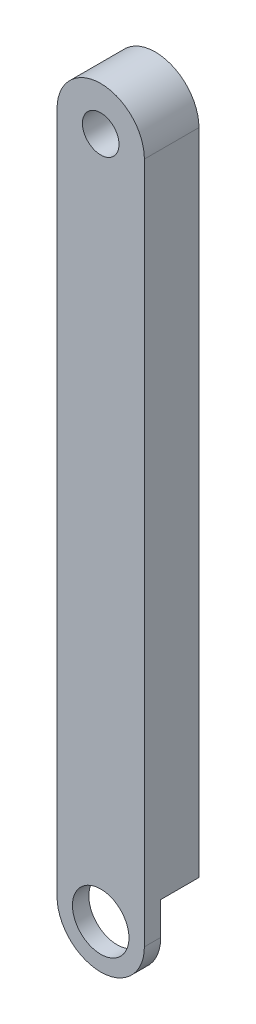
ISO-10303-21;
HEADER;
FILE_DESCRIPTION(('STEP AP214'),'2;1');
FILE_NAME('part.step','',(''),(''),'','','');
FILE_SCHEMA(('AUTOMOTIVE_DESIGN { 1 0 10303 214 1 1 1 1 }'));
ENDSEC;
DATA;
#1=APPLICATION_CONTEXT('core data for automotive mechanical design processes');
#2=APPLICATION_PROTOCOL_DEFINITION('international standard','automotive_design',2000,#1);
#3=PRODUCT_CONTEXT('',#1,'mechanical');
#4=PRODUCT('Part','Part','',(#3));
#5=PRODUCT_RELATED_PRODUCT_CATEGORY('part','',(#4));
#6=PRODUCT_DEFINITION_FORMATION('','',#4);
#7=PRODUCT_DEFINITION_CONTEXT('part definition',#1,'design');
#8=PRODUCT_DEFINITION('design','',#6,#7);
#9=PRODUCT_DEFINITION_SHAPE('','',#8);
#10=(LENGTH_UNIT() NAMED_UNIT(*) SI_UNIT(.MILLI.,.METRE.));
#11=(NAMED_UNIT(*) PLANE_ANGLE_UNIT() SI_UNIT($,.RADIAN.));
#12=(NAMED_UNIT(*) SI_UNIT($,.STERADIAN.) SOLID_ANGLE_UNIT());
#13=UNCERTAINTY_MEASURE_WITH_UNIT(LENGTH_MEASURE(1.E-05),#10,'distance_accuracy_value','');
#14=(GEOMETRIC_REPRESENTATION_CONTEXT(3) GLOBAL_UNCERTAINTY_ASSIGNED_CONTEXT((#13)) GLOBAL_UNIT_ASSIGNED_CONTEXT((#10,
#11,#12)) REPRESENTATION_CONTEXT('',''));
#15=CARTESIAN_POINT('',(0.,0.,0.));
#16=DIRECTION('',(0.,0.,1.));
#17=DIRECTION('',(1.,0.,0.));
#18=AXIS2_PLACEMENT_3D('',#15,#16,#17);
#19=CARTESIAN_POINT('',(-860.552519716724,667.45394098188,376.904950284607));
#20=DIRECTION('',(1.,0.,0.));
#21=DIRECTION('',(0.,0.,-1.));
#22=AXIS2_PLACEMENT_3D('',#19,#20,#21);
#23=PLANE('',#22);
#24=DIRECTION('',(0.,-1.,0.));
#25=VECTOR('',#24,1.);
#26=CARTESIAN_POINT('',(-860.552519716724,667.45394098188,371.824950284607));
#27=LINE('',#26,#25);
#28=CARTESIAN_POINT('',(-860.552519716724,667.45394098188,371.824950284607));
#29=VERTEX_POINT('',#28);
#30=CARTESIAN_POINT('',(-860.552519716724,607.00194098188,371.824950284607));
#31=VERTEX_POINT('',#30);
#32=EDGE_CURVE('E80',#29,#31,#27,.T.);
#33=ORIENTED_EDGE('',*,*,#32,.T.);
#34=DIRECTION('',(0.,0.,-1.));
#35=VECTOR('',#34,1.);
#36=CARTESIAN_POINT('',(-860.552519716724,607.00194098188,375.380950284607));
#37=LINE('',#36,#35);
#38=CARTESIAN_POINT('',(-860.552519716724,607.00194098188,375.380950284607));
#39=VERTEX_POINT('',#38);
#40=EDGE_CURVE('E168',#31,#39,#37,.F.);
#41=ORIENTED_EDGE('',*,*,#40,.T.);
#42=DIRECTION('',(0.,1.,0.));
#43=VECTOR('',#42,1.);
#44=CARTESIAN_POINT('',(-860.552519716724,667.45394098188,375.380950284607));
#45=LINE('',#44,#43);
#46=CARTESIAN_POINT('',(-860.552519716724,603.95394098188,375.380950284607));
#47=VERTEX_POINT('',#46);
#48=EDGE_CURVE('E115',#47,#39,#45,.T.);
#49=ORIENTED_EDGE('',*,*,#48,.F.);
#50=DIRECTION('',(0.,0.,-1.));
#51=VECTOR('',#50,1.);
#52=CARTESIAN_POINT('',(-860.552519716724,603.95394098188,376.904950284607));
#53=LINE('',#52,#51);
#54=CARTESIAN_POINT('',(-860.552519716724,603.95394098188,376.904950284607));
#55=VERTEX_POINT('',#54);
#56=EDGE_CURVE('E113',#55,#47,#53,.T.);
#57=ORIENTED_EDGE('',*,*,#56,.F.);
#58=DIRECTION('',(0.,-1.,0.));
#59=VECTOR('',#58,1.);
#60=CARTESIAN_POINT('',(-860.552519716724,667.45394098188,376.904950284607));
#61=LINE('',#60,#59);
#62=CARTESIAN_POINT('',(-860.552519716724,667.45394098188,376.904950284607));
#63=VERTEX_POINT('',#62);
#64=EDGE_CURVE('E99',#63,#55,#61,.T.);
#65=ORIENTED_EDGE('',*,*,#64,.F.);
#66=DIRECTION('',(0.,0.,-1.));
#67=VECTOR('',#66,1.);
#68=CARTESIAN_POINT('',(-860.552519716724,667.45394098188,376.904950284607));
#69=LINE('',#68,#67);
#70=EDGE_CURVE('E60',#63,#29,#69,.T.);
#71=ORIENTED_EDGE('',*,*,#70,.T.);
#72=EDGE_LOOP('',(#33,#41,#49,#57,#65,#71));
#73=FACE_BOUND('',#72,.T.);
#74=ADVANCED_FACE('F50',(#73),#23,.F.);
#75=CARTESIAN_POINT('',(-856.488519716724,603.95394098188,376.904950284607));
#76=DIRECTION('',(0.,0.,-1.));
#77=DIRECTION('',(-1.,0.,0.));
#78=AXIS2_PLACEMENT_3D('',#75,#76,#77);
#79=CYLINDRICAL_SURFACE('',#78,4.06400000000001);
#80=CARTESIAN_POINT('',(-856.488519716724,603.95394098188,375.380950284607));
#81=DIRECTION('',(0.,0.,-1.));
#82=DIRECTION('',(-1.,0.,0.));
#83=AXIS2_PLACEMENT_3D('',#80,#81,#82);
#84=CIRCLE('',#83,4.06400000000001);
#85=CARTESIAN_POINT('',(-852.424519716724,603.95394098188,375.380950284607));
#86=VERTEX_POINT('',#85);
#87=EDGE_CURVE('E91',#86,#47,#84,.T.);
#88=ORIENTED_EDGE('',*,*,#87,.F.);
#89=DIRECTION('',(0.,0.,-1.));
#90=VECTOR('',#89,1.);
#91=CARTESIAN_POINT('',(-852.424519716724,603.95394098188,376.904950284607));
#92=LINE('',#91,#90);
#93=CARTESIAN_POINT('',(-852.424519716724,603.95394098188,376.904950284607));
#94=VERTEX_POINT('',#93);
#95=EDGE_CURVE('E118',#94,#86,#92,.T.);
#96=ORIENTED_EDGE('',*,*,#95,.F.);
#97=CARTESIAN_POINT('',(-856.488519716724,603.95394098188,376.904950284607));
#98=DIRECTION('',(0.,0.,1.));
#99=DIRECTION('',(1.,0.,0.));
#100=AXIS2_PLACEMENT_3D('',#97,#98,#99);
#101=CIRCLE('',#100,4.06400000000001);
#102=EDGE_CURVE('E104',#55,#94,#101,.T.);
#103=ORIENTED_EDGE('',*,*,#102,.F.);
#104=ORIENTED_EDGE('',*,*,#56,.T.);
#105=EDGE_LOOP('',(#88,#96,#103,#104));
#106=FACE_BOUND('',#105,.T.);
#107=ADVANCED_FACE('F120',(#106),#79,.T.);
#108=CARTESIAN_POINT('',(-852.424519716724,667.45394098188,376.904950284607));
#109=DIRECTION('',(-1.,0.,0.));
#110=DIRECTION('',(0.,0.,1.));
#111=AXIS2_PLACEMENT_3D('',#108,#109,#110);
#112=PLANE('',#111);
#113=DIRECTION('',(0.,0.,-1.));
#114=VECTOR('',#113,1.);
#115=CARTESIAN_POINT('',(-852.424519716724,607.00194098188,375.380950284607));
#116=LINE('',#115,#114);
#117=CARTESIAN_POINT('',(-852.424519716724,607.00194098188,375.380950284607));
#118=VERTEX_POINT('',#117);
#119=CARTESIAN_POINT('',(-852.424519716724,607.00194098188,371.824950284607));
#120=VERTEX_POINT('',#119);
#121=EDGE_CURVE('E13',#118,#120,#116,.T.);
#122=ORIENTED_EDGE('',*,*,#121,.T.);
#123=DIRECTION('',(0.,1.,0.));
#124=VECTOR('',#123,1.);
#125=CARTESIAN_POINT('',(-852.424519716724,667.45394098188,371.824950284607));
#126=LINE('',#125,#124);
#127=CARTESIAN_POINT('',(-852.424519716724,667.45394098188,371.824950284607));
#128=VERTEX_POINT('',#127);
#129=EDGE_CURVE('E137',#120,#128,#126,.T.);
#130=ORIENTED_EDGE('',*,*,#129,.T.);
#131=DIRECTION('',(0.,0.,-1.));
#132=VECTOR('',#131,1.);
#133=CARTESIAN_POINT('',(-852.424519716724,667.45394098188,376.904950284607));
#134=LINE('',#133,#132);
#135=CARTESIAN_POINT('',(-852.424519716724,667.45394098188,376.904950284607));
#136=VERTEX_POINT('',#135);
#137=EDGE_CURVE('E126',#136,#128,#134,.T.);
#138=ORIENTED_EDGE('',*,*,#137,.F.);
#139=DIRECTION('',(0.,1.,0.));
#140=VECTOR('',#139,1.);
#141=CARTESIAN_POINT('',(-852.424519716724,667.45394098188,376.904950284607));
#142=LINE('',#141,#140);
#143=EDGE_CURVE('E68',#94,#136,#142,.T.);
#144=ORIENTED_EDGE('',*,*,#143,.F.);
#145=ORIENTED_EDGE('',*,*,#95,.T.);
#146=DIRECTION('',(0.,-1.,0.));
#147=VECTOR('',#146,1.);
#148=CARTESIAN_POINT('',(-852.424519716724,667.45394098188,375.380950284607));
#149=LINE('',#148,#147);
#150=EDGE_CURVE('E161',#118,#86,#149,.T.);
#151=ORIENTED_EDGE('',*,*,#150,.F.);
#152=EDGE_LOOP('',(#122,#130,#138,#144,#145,#151));
#153=FACE_BOUND('',#152,.T.);
#154=ADVANCED_FACE('F157',(#153),#112,.F.);
#155=CARTESIAN_POINT('',(-856.488519716724,667.45394098188,376.904950284607));
#156=DIRECTION('',(0.,0.,1.));
#157=DIRECTION('',(1.,0.,0.));
#158=AXIS2_PLACEMENT_3D('',#155,#156,#157);
#159=PLANE('',#158);
#160=CARTESIAN_POINT('',(-856.488519716724,603.95394098188,376.904950284607));
#161=DIRECTION('',(0.,0.,1.));
#162=DIRECTION('',(1.,0.,0.));
#163=AXIS2_PLACEMENT_3D('',#160,#161,#162);
#164=CIRCLE('',#163,2.62889999999999);
#165=CARTESIAN_POINT('',(-853.859619716724,603.95394098188,376.904950284607));
#166=VERTEX_POINT('',#165);
#167=EDGE_CURVE('E181',#166,#166,#164,.T.);
#168=ORIENTED_EDGE('',*,*,#167,.F.);
#169=EDGE_LOOP('',(#168));
#170=FACE_BOUND('',#169,.T.);
#171=CARTESIAN_POINT('',(-856.488519716724,667.45394098188,376.904950284607));
#172=DIRECTION('',(0.,0.,1.));
#173=DIRECTION('',(1.,0.,0.));
#174=AXIS2_PLACEMENT_3D('',#171,#172,#173);
#175=CIRCLE('',#174,4.06400000000001);
#176=EDGE_CURVE('E107',#136,#63,#175,.T.);
#177=ORIENTED_EDGE('',*,*,#176,.T.);
#178=ORIENTED_EDGE('',*,*,#64,.T.);
#179=ORIENTED_EDGE('',*,*,#102,.T.);
#180=ORIENTED_EDGE('',*,*,#143,.T.);
#181=EDGE_LOOP('',(#177,#178,#179,#180));
#182=FACE_BOUND('',#181,.T.);
#183=CARTESIAN_POINT('',(-856.488519716724,667.45394098188,376.904950284607));
#184=DIRECTION('',(0.,0.,1.));
#185=DIRECTION('',(1.,0.,0.));
#186=AXIS2_PLACEMENT_3D('',#183,#184,#185);
#187=CIRCLE('',#186,1.70000002900004);
#188=CARTESIAN_POINT('',(-854.788519687724,667.45394098188,376.904950284607));
#189=VERTEX_POINT('',#188);
#190=EDGE_CURVE('E134',#189,#189,#187,.T.);
#191=ORIENTED_EDGE('',*,*,#190,.F.);
#192=EDGE_LOOP('',(#191));
#193=FACE_BOUND('',#192,.T.);
#194=ADVANCED_FACE('F101',(#170,#182,#193),#159,.T.);
#195=CARTESIAN_POINT('',(-856.488519716724,667.45394098188,371.824950284607));
#196=DIRECTION('',(0.,0.,1.));
#197=DIRECTION('',(1.,0.,0.));
#198=AXIS2_PLACEMENT_3D('',#195,#196,#197);
#199=PLANE('',#198);
#200=ORIENTED_EDGE('',*,*,#129,.F.);
#201=CARTESIAN_POINT('',(-856.488519716724,603.95394098188,371.824950284607));
#202=DIRECTION('',(0.,0.,-1.));
#203=DIRECTION('',(-1.,0.,0.));
#204=AXIS2_PLACEMENT_3D('',#201,#202,#203);
#205=CIRCLE('',#204,5.08000000000013);
#206=EDGE_CURVE('E153',#31,#120,#205,.T.);
#207=ORIENTED_EDGE('',*,*,#206,.F.);
#208=ORIENTED_EDGE('',*,*,#32,.F.);
#209=CARTESIAN_POINT('',(-856.488519716724,667.45394098188,371.824950284607));
#210=DIRECTION('',(0.,0.,1.));
#211=DIRECTION('',(1.,0.,0.));
#212=AXIS2_PLACEMENT_3D('',#209,#210,#211);
#213=CIRCLE('',#212,4.06400000000001);
#214=EDGE_CURVE('E130',#128,#29,#213,.T.);
#215=ORIENTED_EDGE('',*,*,#214,.F.);
#216=EDGE_LOOP('',(#200,#207,#208,#215));
#217=FACE_BOUND('',#216,.T.);
#218=CARTESIAN_POINT('',(-856.488519716724,667.45394098188,371.824950284607));
#219=DIRECTION('',(0.,0.,1.));
#220=DIRECTION('',(1.,0.,0.));
#221=AXIS2_PLACEMENT_3D('',#218,#219,#220);
#222=CIRCLE('',#221,1.70000002900004);
#223=CARTESIAN_POINT('',(-854.788519687724,667.45394098188,371.824950284607));
#224=VERTEX_POINT('',#223);
#225=EDGE_CURVE('E237',#224,#224,#222,.T.);
#226=ORIENTED_EDGE('',*,*,#225,.T.);
#227=EDGE_LOOP('',(#226));
#228=FACE_BOUND('',#227,.T.);
#229=ADVANCED_FACE('F149',(#217,#228),#199,.F.);
#230=CARTESIAN_POINT('',(-856.488519716724,667.45394098188,376.904950284607));
#231=DIRECTION('',(0.,0.,-1.));
#232=DIRECTION('',(-1.,0.,0.));
#233=AXIS2_PLACEMENT_3D('',#230,#231,#232);
#234=CYLINDRICAL_SURFACE('',#233,4.06400000000001);
#235=ORIENTED_EDGE('',*,*,#214,.T.);
#236=ORIENTED_EDGE('',*,*,#70,.F.);
#237=ORIENTED_EDGE('',*,*,#176,.F.);
#238=ORIENTED_EDGE('',*,*,#137,.T.);
#239=EDGE_LOOP('',(#235,#236,#237,#238));
#240=FACE_BOUND('',#239,.T.);
#241=ADVANCED_FACE('F52',(#240),#234,.T.);
#242=CARTESIAN_POINT('',(-856.488519716724,667.45394098188,376.904950284607));
#243=DIRECTION('',(0.,0.,-1.));
#244=DIRECTION('',(-1.,0.,0.));
#245=AXIS2_PLACEMENT_3D('',#242,#243,#244);
#246=CYLINDRICAL_SURFACE('',#245,1.70000002900004);
#247=ORIENTED_EDGE('',*,*,#190,.T.);
#248=EDGE_LOOP('',(#247));
#249=FACE_BOUND('',#248,.T.);
#250=ORIENTED_EDGE('',*,*,#225,.F.);
#251=EDGE_LOOP('',(#250));
#252=FACE_BOUND('',#251,.T.);
#253=ADVANCED_FACE('F330',(#249,#252),#246,.F.);
#254=CARTESIAN_POINT('',(-856.488519716724,603.95394098188,375.380950284607));
#255=DIRECTION('',(0.,0.,-1.));
#256=DIRECTION('',(-1.,0.,0.));
#257=AXIS2_PLACEMENT_3D('',#254,#255,#256);
#258=CYLINDRICAL_SURFACE('',#257,5.08);
#259=ORIENTED_EDGE('',*,*,#40,.F.);
#260=ORIENTED_EDGE('',*,*,#206,.T.);
#261=ORIENTED_EDGE('',*,*,#121,.F.);
#262=CARTESIAN_POINT('',(-856.488519716724,603.95394098188,375.380950284607));
#263=DIRECTION('',(0.,0.,-1.));
#264=DIRECTION('',(-1.,0.,0.));
#265=AXIS2_PLACEMENT_3D('',#262,#263,#264);
#266=CIRCLE('',#265,5.08);
#267=CARTESIAN_POINT('',(-853.758019716719,608.23772082566,375.380950284607));
#268=VERTEX_POINT('',#267);
#269=EDGE_CURVE('E200',#268,#118,#266,.T.);
#270=ORIENTED_EDGE('',*,*,#269,.F.);
#271=DIRECTION('',(0.,0.,-1.));
#272=VECTOR('',#271,1.);
#273=CARTESIAN_POINT('',(-853.758019716719,608.23772082566,375.380950284607));
#274=LINE('',#273,#272);
#275=CARTESIAN_POINT('',(-853.758019716703,608.237720825649,373.348950284607));
#276=VERTEX_POINT('',#275);
#277=EDGE_CURVE('E203',#268,#276,#274,.T.);
#278=ORIENTED_EDGE('',*,*,#277,.T.);
#279=CARTESIAN_POINT('',(-856.488519716724,603.95394098188,373.348950284607));
#280=DIRECTION('',(0.,0.,-1.));
#281=DIRECTION('',(-1.,0.,0.));
#282=AXIS2_PLACEMENT_3D('',#279,#280,#281);
#283=CIRCLE('',#282,5.08000000000013);
#284=CARTESIAN_POINT('',(-859.219019716673,608.237720825695,373.348950284607));
#285=VERTEX_POINT('',#284);
#286=EDGE_CURVE('E170',#276,#285,#283,.F.);
#287=ORIENTED_EDGE('',*,*,#286,.T.);
#288=DIRECTION('',(0.,0.,-1.));
#289=VECTOR('',#288,1.);
#290=CARTESIAN_POINT('',(-859.219019716667,608.237720825741,375.380950284607));
#291=LINE('',#290,#289);
#292=CARTESIAN_POINT('',(-859.219019716667,608.237720825741,375.380950284607));
#293=VERTEX_POINT('',#292);
#294=EDGE_CURVE('E217',#293,#285,#291,.T.);
#295=ORIENTED_EDGE('',*,*,#294,.F.);
#296=EDGE_CURVE('E199',#39,#293,#266,.T.);
#297=ORIENTED_EDGE('',*,*,#296,.F.);
#298=EDGE_LOOP('',(#259,#260,#261,#270,#278,#287,#295,#297));
#299=FACE_BOUND('',#298,.T.);
#300=ADVANCED_FACE('F166',(#299),#258,.F.);
#301=CARTESIAN_POINT('',(-856.488519716724,620.320238027836,375.380950284607));
#302=DIRECTION('',(0.,0.,-1.));
#303=DIRECTION('',(-1.,0.,0.));
#304=AXIS2_PLACEMENT_3D('',#301,#302,#303);
#305=PLANE('',#304);
#306=CARTESIAN_POINT('',(-856.488519716724,603.95394098188,375.380950284607));
#307=DIRECTION('',(0.,0.,-1.));
#308=DIRECTION('',(-1.,0.,0.));
#309=AXIS2_PLACEMENT_3D('',#306,#307,#308);
#310=CIRCLE('',#309,2.62889999999999);
#311=CARTESIAN_POINT('',(-859.117419716724,603.95394098188,375.380950284607));
#312=VERTEX_POINT('',#311);
#313=EDGE_CURVE('E175',#312,#312,#310,.T.);
#314=ORIENTED_EDGE('',*,*,#313,.F.);
#315=EDGE_LOOP('',(#314));
#316=FACE_BOUND('',#315,.T.);
#317=ORIENTED_EDGE('',*,*,#48,.T.);
#318=ORIENTED_EDGE('',*,*,#296,.T.);
#319=DIRECTION('',(0.0522466226802802,0.998634212521534,0.));
#320=VECTOR('',#319,1.);
#321=CARTESIAN_POINT('',(-14976.3463822897,-269224.445112286,375.380950284607));
#322=LINE('',#321,#320);
#323=CARTESIAN_POINT('',(-858.58115770906,620.429720825714,375.380950284607));
#324=VERTEX_POINT('',#323);
#325=EDGE_CURVE('E195',#293,#324,#322,.T.);
#326=ORIENTED_EDGE('',*,*,#325,.T.);
#327=CARTESIAN_POINT('',(-856.488519716724,620.320238027836,375.380950284607));
#328=DIRECTION('',(0.,0.,-1.));
#329=DIRECTION('',(-1.,0.,0.));
#330=AXIS2_PLACEMENT_3D('',#327,#328,#329);
#331=CIRCLE('',#330,2.09549999999996);
#332=CARTESIAN_POINT('',(-854.395881724385,620.429720825654,375.380950284607));
#333=VERTEX_POINT('',#332);
#334=EDGE_CURVE('E190',#324,#333,#331,.T.);
#335=ORIENTED_EDGE('',*,*,#334,.T.);
#336=DIRECTION('',(-0.0522466226803074,0.998634212521533,0.));
#337=VECTOR('',#336,1.);
#338=CARTESIAN_POINT('',(15447.2480096047,-310966.778697142,375.380950284607));
#339=LINE('',#338,#337);
#340=EDGE_CURVE('E186',#268,#333,#339,.T.);
#341=ORIENTED_EDGE('',*,*,#340,.F.);
#342=ORIENTED_EDGE('',*,*,#269,.T.);
#343=ORIENTED_EDGE('',*,*,#150,.T.);
#344=ORIENTED_EDGE('',*,*,#87,.T.);
#345=EDGE_LOOP('',(#317,#318,#326,#335,#341,#342,#343,#344));
#346=FACE_BOUND('',#345,.T.);
#347=ADVANCED_FACE('F274',(#316,#346),#305,.T.);
#348=CARTESIAN_POINT('',(-856.488519716724,620.320238027836,373.348950284607));
#349=DIRECTION('',(0.,0.,-1.));
#350=DIRECTION('',(-1.,0.,0.));
#351=AXIS2_PLACEMENT_3D('',#348,#349,#350);
#352=PLANE('',#351);
#353=DIRECTION('',(0.0522466226802802,0.998634212521534,0.));
#354=VECTOR('',#353,1.);
#355=CARTESIAN_POINT('',(-14976.3463822897,-269224.445112286,373.348950284607));
#356=LINE('',#355,#354);
#357=CARTESIAN_POINT('',(-858.58115770906,620.429720825714,373.348950284607));
#358=VERTEX_POINT('',#357);
#359=EDGE_CURVE('E191',#285,#358,#356,.T.);
#360=ORIENTED_EDGE('',*,*,#359,.F.);
#361=ORIENTED_EDGE('',*,*,#286,.F.);
#362=DIRECTION('',(-0.0522466226803074,0.998634212521533,0.));
#363=VECTOR('',#362,1.);
#364=CARTESIAN_POINT('',(15447.2480096047,-310966.778697142,373.348950284607));
#365=LINE('',#364,#363);
#366=CARTESIAN_POINT('',(-854.395881724385,620.429720825654,373.348950284607));
#367=VERTEX_POINT('',#366);
#368=EDGE_CURVE('E185',#276,#367,#365,.T.);
#369=ORIENTED_EDGE('',*,*,#368,.T.);
#370=CARTESIAN_POINT('',(-856.488519716724,620.320238027836,373.348950284607));
#371=DIRECTION('',(0.,0.,-1.));
#372=DIRECTION('',(-1.,0.,0.));
#373=AXIS2_PLACEMENT_3D('',#370,#371,#372);
#374=CIRCLE('',#373,2.09549999999996);
#375=EDGE_CURVE('E207',#358,#367,#374,.T.);
#376=ORIENTED_EDGE('',*,*,#375,.F.);
#377=EDGE_LOOP('',(#360,#361,#369,#376));
#378=FACE_BOUND('',#377,.T.);
#379=ADVANCED_FACE('F307',(#378),#352,.F.);
#380=CARTESIAN_POINT('',(15447.2480096047,-310966.778697142,375.380950284607));
#381=DIRECTION('',(-0.998634212521533,-0.0522466226803074,0.));
#382=DIRECTION('',(0.0522466226803074,-0.998634212521533,0.));
#383=AXIS2_PLACEMENT_3D('',#380,#381,#382);
#384=PLANE('',#383);
#385=ORIENTED_EDGE('',*,*,#368,.F.);
#386=ORIENTED_EDGE('',*,*,#277,.F.);
#387=ORIENTED_EDGE('',*,*,#340,.T.);
#388=DIRECTION('',(0.,0.,-1.));
#389=VECTOR('',#388,1.);
#390=CARTESIAN_POINT('',(-854.395881724385,620.429720825654,375.380950284607));
#391=LINE('',#390,#389);
#392=EDGE_CURVE('E225',#333,#367,#391,.T.);
#393=ORIENTED_EDGE('',*,*,#392,.T.);
#394=EDGE_LOOP('',(#385,#386,#387,#393));
#395=FACE_BOUND('',#394,.T.);
#396=ADVANCED_FACE('F308',(#395),#384,.T.);
#397=CARTESIAN_POINT('',(-856.488519716724,620.320238027836,375.380950284607));
#398=DIRECTION('',(0.,0.,-1.));
#399=DIRECTION('',(-1.,0.,0.));
#400=AXIS2_PLACEMENT_3D('',#397,#398,#399);
#401=CYLINDRICAL_SURFACE('',#400,2.09549999999996);
#402=ORIENTED_EDGE('',*,*,#375,.T.);
#403=ORIENTED_EDGE('',*,*,#392,.F.);
#404=ORIENTED_EDGE('',*,*,#334,.F.);
#405=DIRECTION('',(0.,0.,-1.));
#406=VECTOR('',#405,1.);
#407=CARTESIAN_POINT('',(-858.58115770906,620.429720825714,375.380950284607));
#408=LINE('',#407,#406);
#409=EDGE_CURVE('E221',#324,#358,#408,.T.);
#410=ORIENTED_EDGE('',*,*,#409,.T.);
#411=EDGE_LOOP('',(#402,#403,#404,#410));
#412=FACE_BOUND('',#411,.T.);
#413=ADVANCED_FACE('F291',(#412),#401,.F.);
#414=CARTESIAN_POINT('',(-14976.3463822897,-269224.445112286,375.380950284607));
#415=DIRECTION('',(-0.998634212521534,0.0522466226802802,0.));
#416=DIRECTION('',(-0.0522466226802802,-0.998634212521534,0.));
#417=AXIS2_PLACEMENT_3D('',#414,#415,#416);
#418=PLANE('',#417);
#419=ORIENTED_EDGE('',*,*,#359,.T.);
#420=ORIENTED_EDGE('',*,*,#409,.F.);
#421=ORIENTED_EDGE('',*,*,#325,.F.);
#422=ORIENTED_EDGE('',*,*,#294,.T.);
#423=EDGE_LOOP('',(#419,#420,#421,#422));
#424=FACE_BOUND('',#423,.T.);
#425=ADVANCED_FACE('F283',(#424),#418,.F.);
#426=CARTESIAN_POINT('',(-856.488519716724,603.95394098188,377.412950284607));
#427=DIRECTION('',(0.,0.,-1.));
#428=DIRECTION('',(-1.,0.,0.));
#429=AXIS2_PLACEMENT_3D('',#426,#427,#428);
#430=CYLINDRICAL_SURFACE('',#429,2.62889999999999);
#431=ORIENTED_EDGE('',*,*,#167,.T.);
#432=EDGE_LOOP('',(#431));
#433=FACE_BOUND('',#432,.T.);
#434=ORIENTED_EDGE('',*,*,#313,.T.);
#435=EDGE_LOOP('',(#434));
#436=FACE_BOUND('',#435,.T.);
#437=ADVANCED_FACE('F373',(#433,#436),#430,.F.);
#438=CLOSED_SHELL('',(#74,#107,#154,#194,#229,#241,#253,#300,#347,#379,#396,#413,#425,#437));
#439=MANIFOLD_SOLID_BREP('B2',#438);
#440=ADVANCED_BREP_SHAPE_REPRESENTATION('',(#18,#439),#14);
#441=SHAPE_DEFINITION_REPRESENTATION(#9,#440);
ENDSEC;
END-ISO-10303-21;
